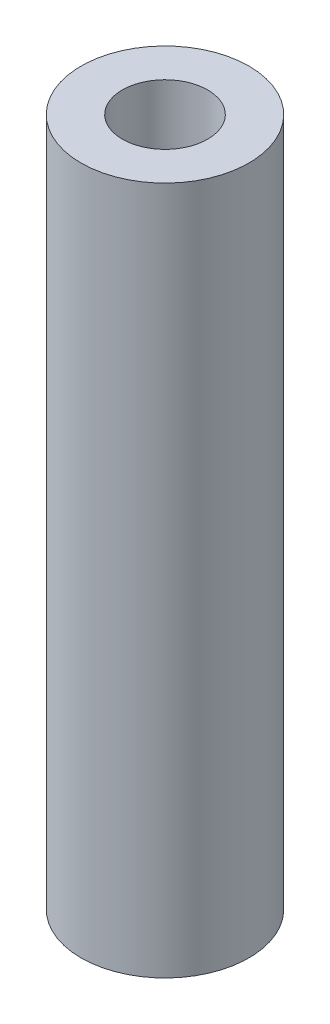
ISO-10303-21;
HEADER;
FILE_DESCRIPTION(('STEP AP214'),'2;1');
FILE_NAME('part.step','',(''),(''),'','','');
FILE_SCHEMA(('AUTOMOTIVE_DESIGN { 1 0 10303 214 1 1 1 1 }'));
ENDSEC;
DATA;
#1=APPLICATION_CONTEXT('core data for automotive mechanical design processes');
#2=APPLICATION_PROTOCOL_DEFINITION('international standard','automotive_design',2000,#1);
#3=PRODUCT_CONTEXT('',#1,'mechanical');
#4=PRODUCT('Part','Part','',(#3));
#5=PRODUCT_RELATED_PRODUCT_CATEGORY('part','',(#4));
#6=PRODUCT_DEFINITION_FORMATION('','',#4);
#7=PRODUCT_DEFINITION_CONTEXT('part definition',#1,'design');
#8=PRODUCT_DEFINITION('design','',#6,#7);
#9=PRODUCT_DEFINITION_SHAPE('','',#8);
#10=(LENGTH_UNIT() NAMED_UNIT(*) SI_UNIT(.MILLI.,.METRE.));
#11=(NAMED_UNIT(*) PLANE_ANGLE_UNIT() SI_UNIT($,.RADIAN.));
#12=(NAMED_UNIT(*) SI_UNIT($,.STERADIAN.) SOLID_ANGLE_UNIT());
#13=UNCERTAINTY_MEASURE_WITH_UNIT(LENGTH_MEASURE(1.E-05),#10,'distance_accuracy_value','');
#14=(GEOMETRIC_REPRESENTATION_CONTEXT(3) GLOBAL_UNCERTAINTY_ASSIGNED_CONTEXT((#13)) GLOBAL_UNIT_ASSIGNED_CONTEXT((#10,
#11,#12)) REPRESENTATION_CONTEXT('',''));
#15=CARTESIAN_POINT('',(0.,0.,0.));
#16=DIRECTION('',(0.,0.,1.));
#17=DIRECTION('',(1.,0.,0.));
#18=AXIS2_PLACEMENT_3D('',#15,#16,#17);
#19=CARTESIAN_POINT('',(0.,25.,0.));
#20=DIRECTION('',(0.,1.,0.));
#21=DIRECTION('',(0.,0.,1.));
#22=AXIS2_PLACEMENT_3D('',#19,#20,#21);
#23=PLANE('',#22);
#24=CARTESIAN_POINT('',(0.,25.,0.));
#25=DIRECTION('',(0.,1.,0.));
#26=DIRECTION('',(0.,0.,1.));
#27=AXIS2_PLACEMENT_3D('',#24,#25,#26);
#28=CIRCLE('',#27,3.05);
#29=CARTESIAN_POINT('',(0.,25.,3.05));
#30=VERTEX_POINT('',#29);
#31=EDGE_CURVE('E10',#30,#30,#28,.T.);
#32=ORIENTED_EDGE('',*,*,#31,.T.);
#33=EDGE_LOOP('',(#32));
#34=FACE_BOUND('',#33,.T.);
#35=CARTESIAN_POINT('',(0.,25.,0.));
#36=DIRECTION('',(0.,1.,0.));
#37=DIRECTION('',(0.,0.,1.));
#38=AXIS2_PLACEMENT_3D('',#35,#36,#37);
#39=CIRCLE('',#38,1.55);
#40=CARTESIAN_POINT('',(0.,25.,1.55));
#41=VERTEX_POINT('',#40);
#42=EDGE_CURVE('E50',#41,#41,#39,.T.);
#43=ORIENTED_EDGE('',*,*,#42,.F.);
#44=EDGE_LOOP('',(#43));
#45=FACE_BOUND('',#44,.T.);
#46=ADVANCED_FACE('F37',(#34,#45),#23,.T.);
#47=CARTESIAN_POINT('',(0.,0.,0.));
#48=DIRECTION('',(0.,1.,0.));
#49=DIRECTION('',(0.,0.,1.));
#50=AXIS2_PLACEMENT_3D('',#47,#48,#49);
#51=PLANE('',#50);
#52=CARTESIAN_POINT('',(0.,0.,0.));
#53=DIRECTION('',(0.,1.,0.));
#54=DIRECTION('',(0.,0.,1.));
#55=AXIS2_PLACEMENT_3D('',#52,#53,#54);
#56=CIRCLE('',#55,3.05);
#57=CARTESIAN_POINT('',(0.,0.,3.05));
#58=VERTEX_POINT('',#57);
#59=EDGE_CURVE('E41',#58,#58,#56,.T.);
#60=ORIENTED_EDGE('',*,*,#59,.F.);
#61=EDGE_LOOP('',(#60));
#62=FACE_BOUND('',#61,.T.);
#63=CARTESIAN_POINT('',(0.,0.,0.));
#64=DIRECTION('',(0.,1.,0.));
#65=DIRECTION('',(0.,0.,1.));
#66=AXIS2_PLACEMENT_3D('',#63,#64,#65);
#67=CIRCLE('',#66,1.55);
#68=CARTESIAN_POINT('',(0.,0.,1.55));
#69=VERTEX_POINT('',#68);
#70=EDGE_CURVE('E52',#69,#69,#67,.T.);
#71=ORIENTED_EDGE('',*,*,#70,.T.);
#72=EDGE_LOOP('',(#71));
#73=FACE_BOUND('',#72,.T.);
#74=ADVANCED_FACE('F64',(#62,#73),#51,.F.);
#75=CARTESIAN_POINT('',(0.,25.,0.));
#76=DIRECTION('',(0.,-1.,0.));
#77=DIRECTION('',(0.,0.,-1.));
#78=AXIS2_PLACEMENT_3D('',#75,#76,#77);
#79=CYLINDRICAL_SURFACE('',#78,3.05);
#80=ORIENTED_EDGE('',*,*,#31,.F.);
#81=EDGE_LOOP('',(#80));
#82=FACE_BOUND('',#81,.T.);
#83=ORIENTED_EDGE('',*,*,#59,.T.);
#84=EDGE_LOOP('',(#83));
#85=FACE_BOUND('',#84,.T.);
#86=ADVANCED_FACE('F39',(#82,#85),#79,.T.);
#87=CARTESIAN_POINT('',(0.,25.,0.));
#88=DIRECTION('',(0.,-1.,0.));
#89=DIRECTION('',(0.,0.,-1.));
#90=AXIS2_PLACEMENT_3D('',#87,#88,#89);
#91=CYLINDRICAL_SURFACE('',#90,1.55);
#92=ORIENTED_EDGE('',*,*,#42,.T.);
#93=EDGE_LOOP('',(#92));
#94=FACE_BOUND('',#93,.T.);
#95=ORIENTED_EDGE('',*,*,#70,.F.);
#96=EDGE_LOOP('',(#95));
#97=FACE_BOUND('',#96,.T.);
#98=ADVANCED_FACE('F60',(#94,#97),#91,.F.);
#99=CLOSED_SHELL('',(#46,#74,#86,#98));
#100=MANIFOLD_SOLID_BREP('B2',#99);
#101=ADVANCED_BREP_SHAPE_REPRESENTATION('',(#18,#100),#14);
#102=SHAPE_DEFINITION_REPRESENTATION(#9,#101);
ENDSEC;
END-ISO-10303-21;
